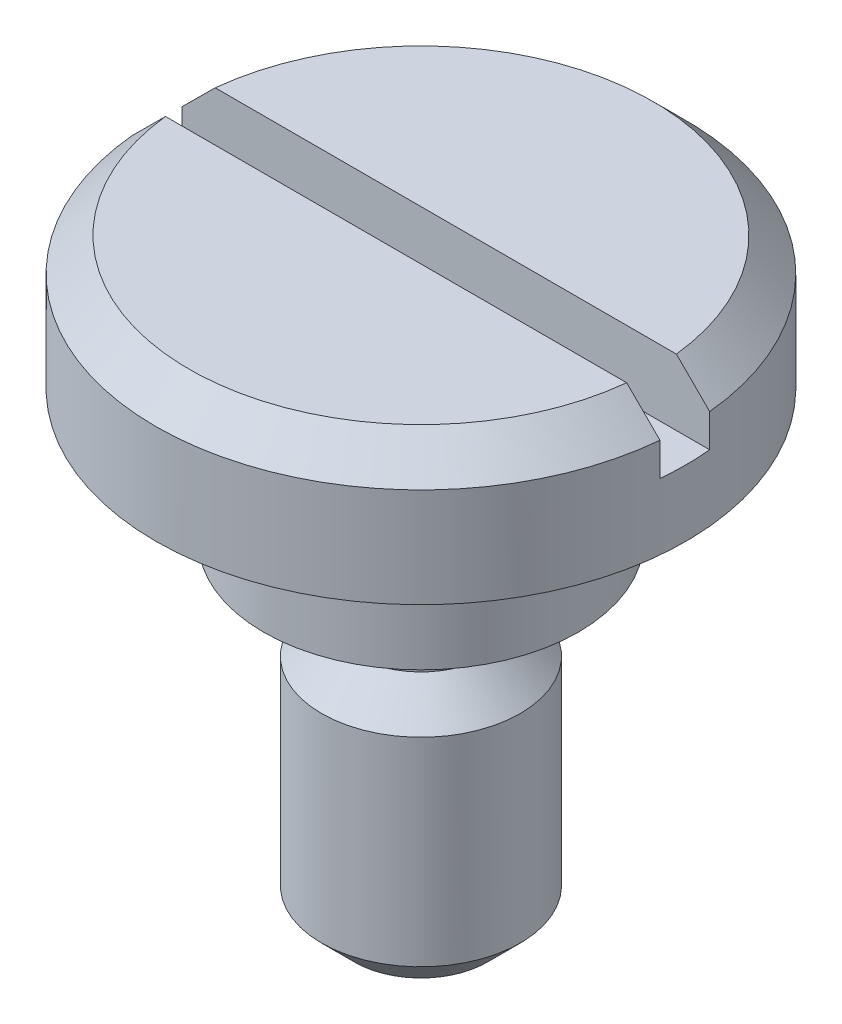
ISO-10303-21;
HEADER;
FILE_DESCRIPTION(('STEP AP214'),'2;1');
FILE_NAME('part.step','',(''),(''),'','','');
FILE_SCHEMA(('AUTOMOTIVE_DESIGN { 1 0 10303 214 1 1 1 1 }'));
ENDSEC;
DATA;
#1=APPLICATION_CONTEXT('core data for automotive mechanical design processes');
#2=APPLICATION_PROTOCOL_DEFINITION('international standard','automotive_design',2000,#1);
#3=PRODUCT_CONTEXT('',#1,'mechanical');
#4=PRODUCT('Part','Part','',(#3));
#5=PRODUCT_RELATED_PRODUCT_CATEGORY('part','',(#4));
#6=PRODUCT_DEFINITION_FORMATION('','',#4);
#7=PRODUCT_DEFINITION_CONTEXT('part definition',#1,'design');
#8=PRODUCT_DEFINITION('design','',#6,#7);
#9=PRODUCT_DEFINITION_SHAPE('','',#8);
#10=(LENGTH_UNIT() NAMED_UNIT(*) SI_UNIT(.MILLI.,.METRE.));
#11=(NAMED_UNIT(*) PLANE_ANGLE_UNIT() SI_UNIT($,.RADIAN.));
#12=(NAMED_UNIT(*) SI_UNIT($,.STERADIAN.) SOLID_ANGLE_UNIT());
#13=UNCERTAINTY_MEASURE_WITH_UNIT(LENGTH_MEASURE(1.E-05),#10,'distance_accuracy_value','');
#14=(GEOMETRIC_REPRESENTATION_CONTEXT(3) GLOBAL_UNCERTAINTY_ASSIGNED_CONTEXT((#13)) GLOBAL_UNIT_ASSIGNED_CONTEXT((#10,
#11,#12)) REPRESENTATION_CONTEXT('',''));
#15=CARTESIAN_POINT('',(0.,0.,0.));
#16=DIRECTION('',(0.,0.,1.));
#17=DIRECTION('',(1.,0.,0.));
#18=AXIS2_PLACEMENT_3D('',#15,#16,#17);
#19=CARTESIAN_POINT('',(8.,18.,0.));
#20=DIRECTION('',(0.,-1.,0.));
#21=DIRECTION('',(0.,0.,-1.));
#22=AXIS2_PLACEMENT_3D('',#19,#20,#21);
#23=PLANE('',#22);
#24=CARTESIAN_POINT('',(0.,18.,0.));
#25=DIRECTION('',(0.,-1.,0.));
#26=DIRECTION('',(0.,0.,-1.));
#27=AXIS2_PLACEMENT_3D('',#24,#25,#26);
#28=CIRCLE('',#27,7.);
#29=CARTESIAN_POINT('',(6.95970545353753,18.,-0.75));
#30=VERTEX_POINT('',#29);
#31=CARTESIAN_POINT('',(-6.95970545353753,18.,-0.75));
#32=VERTEX_POINT('',#31);
#33=EDGE_CURVE('E147',#30,#32,#28,.F.);
#34=ORIENTED_EDGE('',*,*,#33,.T.);
#35=DIRECTION('',(-1.,0.,0.));
#36=VECTOR('',#35,1.);
#37=CARTESIAN_POINT('',(-7.964766161037,18.,-0.75));
#38=LINE('',#37,#36);
#39=EDGE_CURVE('E108',#30,#32,#38,.T.);
#40=ORIENTED_EDGE('',*,*,#39,.F.);
#41=EDGE_LOOP('',(#34,#40));
#42=FACE_BOUND('',#41,.T.);
#43=ADVANCED_FACE('F34',(#42),#23,.F.);
#44=CARTESIAN_POINT('',(0.,18.,0.));
#45=DIRECTION('',(0.,-1.,0.));
#46=DIRECTION('',(0.,0.,-1.));
#47=AXIS2_PLACEMENT_3D('',#44,#45,#46);
#48=CONICAL_SURFACE('',#47,7.,0.785398163397447);
#49=CARTESIAN_POINT('',(17.5414999807444,7.44247393353899,-0.75));
#50=CARTESIAN_POINT('',(16.934728151679,8.04868746151241,-0.75));
#51=CARTESIAN_POINT('',(16.3279318310208,8.65487648238281,-0.75));
#52=CARTESIAN_POINT('',(15.1142562360308,9.86717583287513,-0.75));
#53=CARTESIAN_POINT('',(14.5073769614089,10.4732861622067,-0.75));
#54=CARTESIAN_POINT('',(13.2934560776545,11.6854437937345,-0.75));
#55=CARTESIAN_POINT('',(12.6864144592914,12.2914910866875,-0.75));
#56=CARTESIAN_POINT('',(11.4721610260657,13.5034109072837,-0.75));
#57=CARTESIAN_POINT('',(10.8649492118057,14.1092834355306,-0.75));
#58=CARTESIAN_POINT('',(9.65119667440748,15.3198088995362,-0.75));
#59=CARTESIAN_POINT('',(9.0446563796733,15.9244622647251,-0.75));
#60=CARTESIAN_POINT('',(8.13446986233438,16.831071345008,-0.75));
#61=CARTESIAN_POINT('',(7.83101003719044,17.1332141748789,-0.75));
#62=CARTESIAN_POINT('',(7.22391300253392,17.7373209392757,-0.75));
#63=CARTESIAN_POINT('',(6.92027579321098,18.0392848739921,-0.75));
#64=CARTESIAN_POINT('',(6.31275850317933,18.6429376578914,-0.75));
#65=CARTESIAN_POINT('',(6.00887843554389,18.9446265202264,-0.75));
#66=CARTESIAN_POINT('',(5.4007156174535,19.5476006086176,-0.75));
#67=CARTESIAN_POINT('',(5.09643286535552,19.8488858330169,-0.75));
#68=CARTESIAN_POINT('',(4.48721680699417,20.4507873145134,-0.75));
#69=CARTESIAN_POINT('',(4.18228351313859,20.7514035841502,-0.75));
#70=CARTESIAN_POINT('',(3.72395411736519,21.2013795844683,-0.75));
#71=CARTESIAN_POINT('',(3.57102325198566,21.3512130215695,-0.75));
#72=CARTESIAN_POINT('',(3.26470738597547,21.6504147852155,-0.75));
#73=CARTESIAN_POINT('',(3.11132238644353,21.7997831128838,-0.75));
#74=CARTESIAN_POINT('',(2.87344112197552,22.0303633901401,-0.75));
#75=CARTESIAN_POINT('',(2.78918674736266,22.1118248082896,-0.75));
#76=CARTESIAN_POINT('',(2.62040758518399,22.2744677855789,-0.75));
#77=CARTESIAN_POINT('',(2.53588279658871,22.3556493436509,-0.75));
#78=CARTESIAN_POINT('',(2.36644400534045,22.5176745333187,-0.75));
#79=CARTESIAN_POINT('',(2.28152985917243,22.5985180150561,-0.75));
#80=CARTESIAN_POINT('',(2.11121670939019,22.7596911220157,-0.75));
#81=CARTESIAN_POINT('',(2.02581770947637,22.8400207511496,-0.75));
#82=CARTESIAN_POINT('',(1.82527076370352,23.0270923741969,-0.75));
#83=CARTESIAN_POINT('',(1.70985722780419,23.133551452882,-0.75));
#84=CARTESIAN_POINT('',(1.53525461072994,23.2915201207219,-0.75));
#85=CARTESIAN_POINT('',(1.4768284843556,23.3438707141749,-0.75));
#86=CARTESIAN_POINT('',(1.35928034463948,23.4477787299597,-0.75));
#87=CARTESIAN_POINT('',(1.30015835814015,23.4993361827106,-0.75));
#88=CARTESIAN_POINT('',(1.15799131163724,23.621022220434,-0.75));
#89=CARTESIAN_POINT('',(1.0745091776994,23.6906488541161,-0.75));
#90=CARTESIAN_POINT('',(0.946894886136252,23.7923316941438,-0.75));
#91=CARTESIAN_POINT('',(0.903898977472858,23.8258095104373,-0.75));
#92=CARTESIAN_POINT('',(0.816885694502643,23.8914071251364,-0.75));
#93=CARTESIAN_POINT('',(0.772868497697684,23.9235271568294,-0.75));
#94=CARTESIAN_POINT('',(0.692982657221037,23.9791718137958,-0.75));
#95=CARTESIAN_POINT('',(0.65737565135847,24.003069880508,-0.75));
#96=CARTESIAN_POINT('',(0.585063694272162,24.0491992537746,-0.75));
#97=CARTESIAN_POINT('',(0.548358238710389,24.0714297777506,-0.75));
#98=CARTESIAN_POINT('',(0.473720096188374,24.1134547675553,-0.75));
#99=CARTESIAN_POINT('',(0.435791979005951,24.133257217005,-0.75));
#100=CARTESIAN_POINT('',(0.358375955998073,24.1694794840139,-0.75));
#101=CARTESIAN_POINT('',(0.318889927131749,24.1859032323201,-0.75));
#102=CARTESIAN_POINT('',(0.233864997275498,24.2154964657084,-0.75));
#103=CARTESIAN_POINT('',(0.188130389790622,24.2281300615748,-0.75));
#104=CARTESIAN_POINT('',(0.0952562653113295,24.2453353611093,-0.75));
#105=CARTESIAN_POINT('',(0.0481228412745304,24.2499379436973,-0.75));
#106=CARTESIAN_POINT('',(-0.0463420306781742,24.2500610091859,-0.75));
#107=CARTESIAN_POINT('',(-0.0936735338268117,24.2455459932391,-0.75));
#108=CARTESIAN_POINT('',(-0.186916004822306,24.2284362039912,-0.75));
#109=CARTESIAN_POINT('',(-0.232821637633051,24.2158142055641,-0.75));
#110=CARTESIAN_POINT('',(-0.326356777383562,24.183352972457,-0.75));
#111=CARTESIAN_POINT('',(-0.373795005324548,24.1629863962204,-0.75));
#112=CARTESIAN_POINT('',(-0.466480009797687,24.1176933624451,-0.75));
#113=CARTESIAN_POINT('',(-0.511722235371977,24.0927579074272,-0.75));
#114=CARTESIAN_POINT('',(-0.60077031443497,24.0397197682557,-0.75));
#115=CARTESIAN_POINT('',(-0.644561752123617,24.0115933045801,-0.75));
#116=CARTESIAN_POINT('',(-0.730728584600763,23.9533579234847,-0.75));
#117=CARTESIAN_POINT('',(-0.773105280843004,23.9232509082661,-0.75));
#118=CARTESIAN_POINT('',(-0.860966692603694,23.8586004765428,-0.75));
#119=CARTESIAN_POINT('',(-0.906344484700828,23.8239127286333,-0.75));
#120=CARTESIAN_POINT('',(-0.996179963196423,23.7533616832507,-0.75));
#121=CARTESIAN_POINT('',(-1.04063753157697,23.7174982365005,-0.75));
#122=CARTESIAN_POINT('',(-1.17301852220233,23.6086255494271,-0.75));
#123=CARTESIAN_POINT('',(-1.2599095777572,23.5343648950202,-0.75));
#124=CARTESIAN_POINT('',(-1.43218917663693,23.3838505880067,-0.75));
#125=CARTESIAN_POINT('',(-1.51757490297324,23.307593750691,-0.75));
#126=CARTESIAN_POINT('',(-1.6872501711054,23.1539173411141,-0.75));
#127=CARTESIAN_POINT('',(-1.77154000102016,23.0764980864864,-0.75));
#128=CARTESIAN_POINT('',(-1.93908533695122,22.9211600557452,-0.75));
#129=CARTESIAN_POINT('',(-2.02234349311562,22.8432441287644,-0.75));
#130=CARTESIAN_POINT('',(-2.1883514573688,22.686861916576,-0.75));
#131=CARTESIAN_POINT('',(-2.27110123054651,22.6083955943473,-0.75));
#132=CARTESIAN_POINT('',(-2.43614056869015,22.4511463950928,-0.75));
#133=CARTESIAN_POINT('',(-2.51843051238197,22.3723639151283,-0.75));
#134=CARTESIAN_POINT('',(-2.68272315787688,22.214503950753,-0.75));
#135=CARTESIAN_POINT('',(-2.76472586619171,22.1354264731149,-0.75));
#136=CARTESIAN_POINT('',(-3.00977722094826,21.8984658074307,-0.75));
#137=CARTESIAN_POINT('',(-3.17250263509665,21.7402484571436,-0.75));
#138=CARTESIAN_POINT('',(-3.49740744762284,21.4232538641054,-0.75));
#139=CARTESIAN_POINT('',(-3.65958684409579,21.2644766194051,-0.75));
#140=CARTESIAN_POINT('',(-4.14558747494641,20.7875862935705,-0.75));
#141=CARTESIAN_POINT('',(-4.46886563377819,20.468919985165,-0.75));
#142=CARTESIAN_POINT('',(-5.11481744847834,19.8307201509278,-0.75));
#143=CARTESIAN_POINT('',(-5.43749081303535,19.5111863307702,-0.75));
#144=CARTESIAN_POINT('',(-6.08239683995091,18.871679274844,-0.75));
#145=CARTESIAN_POINT('',(-6.40462950571272,18.5517060425074,-0.75));
#146=CARTESIAN_POINT('',(-7.04895014607176,17.9113517083914,-0.75));
#147=CARTESIAN_POINT('',(-7.37103800826922,17.5909704935642,-0.75));
#148=CARTESIAN_POINT('',(-8.01502708700071,16.95001921742,-0.75));
#149=CARTESIAN_POINT('',(-8.33692830314804,16.6294491557143,-0.75));
#150=CARTESIAN_POINT('',(-9.30236300677203,15.6676192714648,-0.75));
#151=CARTESIAN_POINT('',(-9.94570272604848,15.0261649744973,-0.75));
#152=CARTESIAN_POINT('',(-11.168707881798,13.8062110617127,-0.75));
#153=CARTESIAN_POINT('',(-11.7483995935197,13.2277377795248,-0.75));
#154=CARTESIAN_POINT('',(-12.9076562096521,12.0706208222212,-0.75));
#155=CARTESIAN_POINT('',(-13.4872211085099,11.4919771415424,-0.75));
#156=CARTESIAN_POINT('',(-14.6459557776394,10.3348859776015,-0.75));
#157=CARTESIAN_POINT('',(-15.2251255985507,9.75643854504722,-0.75));
#158=CARTESIAN_POINT('',(-16.3833711958862,8.59949298073518,-0.75));
#159=CARTESIAN_POINT('',(-16.9624469750233,8.02099485169352,-0.75));
#160=CARTESIAN_POINT('',(-17.5414999807444,7.44247393353899,-0.75));
#161=B_SPLINE_CURVE_WITH_KNOTS('',3,(#49,#50,#51,#52,#53,#54,#55,#56,#57,#58,#59,#60,#61,#62,
#63,#64,#65,#66,#67,#68,#69,#70,#71,#72,#73,#74,#75,#76,#77,#78,#79,#80,#81,#82,#83,#84,#85,#86,
#87,#88,#89,#90,#91,#92,#93,#94,#95,#96,#97,#98,#99,#100,#101,#102,#103,#104,#105,#106,#107,
#108,#109,#110,#111,#112,#113,#114,#115,#116,#117,#118,#119,#120,#121,#122,#123,#124,#125,#126,
#127,#128,#129,#130,#131,#132,#133,#134,#135,#136,#137,#138,#139,#140,#141,#142,#143,#144,#145,
#146,#147,#148,#149,#150,#151,#152,#153,#154,#155,#156,#157,#158,#159,#160),.UNSPECIFIED.,.F.,
.F.,(4,2,2,2,2,2,2,2,2,2,2,2,2,2,2,2,2,2,2,2,2,2,2,2,2,2,2,2,2,2,2,2,2,2,2,2,2,2,2,2,2,2,2,2,2,
2,2,2,2,2,2,2,2,2,2,4),(0.,2.57313079333365,5.14627082615952,7.7196218510383,10.2929638775751,
12.8622965532835,14.1469767696476,15.4316556150889,16.7162694249575,18.0008884925675,
19.2854832738205,19.9277764015614,20.5700679766136,20.9216536893458,21.2732407421641,
21.624969911041,21.9766963991221,22.4477226520162,22.6830624330438,22.9183931655176,
23.2444345257297,23.4078943970678,23.5713260684801,23.6999427338593,23.8286193862769,
23.956860902481,24.084952369373,24.2267429529488,24.367987146148,24.5097823257481,
24.6520561939772,24.8065659402138,24.9613832977728,25.1174412949235,25.2733515363281,
25.4446757166793,25.6160217347512,25.958866897718,26.3022971092459,26.6456351264356,
26.9877217466527,27.3298316013911,27.671597873188,28.013356346195,28.6942433756894,
29.3751327780866,30.7369346679044,32.0992777814276,33.4616103142851,34.8244977613737,
36.1873880219317,38.9128504459929,41.3696907461415,43.8266229233735,46.2823004252135,
48.7378858030532),.UNSPECIFIED.);
#162=CARTESIAN_POINT('',(7.964766161037,17.,-0.75));
#163=VERTEX_POINT('',#162);
#164=EDGE_CURVE('E11',#163,#30,#161,.T.);
#165=ORIENTED_EDGE('',*,*,#164,.F.);
#166=CARTESIAN_POINT('',(0.,17.,0.));
#167=DIRECTION('',(0.,-1.,0.));
#168=DIRECTION('',(0.,0.,-1.));
#169=AXIS2_PLACEMENT_3D('',#166,#167,#168);
#170=CIRCLE('',#169,8.);
#171=CARTESIAN_POINT('',(-7.964766161037,17.,-0.75));
#172=VERTEX_POINT('',#171);
#173=EDGE_CURVE('E151',#172,#163,#170,.T.);
#174=ORIENTED_EDGE('',*,*,#173,.F.);
#175=EDGE_CURVE('E39',#32,#172,#161,.T.);
#176=ORIENTED_EDGE('',*,*,#175,.F.);
#177=ORIENTED_EDGE('',*,*,#33,.F.);
#178=EDGE_LOOP('',(#165,#174,#176,#177));
#179=FACE_BOUND('',#178,.T.);
#180=ADVANCED_FACE('F195',(#179),#48,.T.);
#181=CARTESIAN_POINT('',(0.,0.,0.));
#182=DIRECTION('',(0.,1.,0.));
#183=DIRECTION('',(0.,0.,1.));
#184=AXIS2_PLACEMENT_3D('',#181,#182,#183);
#185=PLANE('',#184);
#186=CARTESIAN_POINT('',(0.,0.,0.));
#187=DIRECTION('',(0.,1.,0.));
#188=DIRECTION('',(0.,0.,1.));
#189=AXIS2_PLACEMENT_3D('',#186,#187,#188);
#190=CIRCLE('',#189,2.);
#191=CARTESIAN_POINT('',(0.,0.,2.));
#192=VERTEX_POINT('',#191);
#193=EDGE_CURVE('E144',#192,#192,#190,.F.);
#194=ORIENTED_EDGE('',*,*,#193,.T.);
#195=EDGE_LOOP('',(#194));
#196=FACE_BOUND('',#195,.T.);
#197=ADVANCED_FACE('F191',(#196),#185,.F.);
#198=CARTESIAN_POINT('',(0.,18.,0.));
#199=DIRECTION('',(0.,1.,0.));
#200=DIRECTION('',(0.,0.,1.));
#201=AXIS2_PLACEMENT_3D('',#198,#199,#200);
#202=CYLINDRICAL_SURFACE('',#201,3.);
#203=CARTESIAN_POINT('',(0.,6.99999999999999,0.));
#204=DIRECTION('',(0.,-1.,0.));
#205=DIRECTION('',(0.,0.,-1.));
#206=AXIS2_PLACEMENT_3D('',#203,#204,#205);
#207=CIRCLE('',#206,3.);
#208=CARTESIAN_POINT('',(0.,6.99999999999999,-3.));
#209=VERTEX_POINT('',#208);
#210=EDGE_CURVE('E141',#209,#209,#207,.T.);
#211=ORIENTED_EDGE('',*,*,#210,.T.);
#212=EDGE_LOOP('',(#211));
#213=FACE_BOUND('',#212,.T.);
#214=CARTESIAN_POINT('',(0.,0.999999999999997,0.));
#215=DIRECTION('',(0.,1.,0.));
#216=DIRECTION('',(0.,0.,1.));
#217=AXIS2_PLACEMENT_3D('',#214,#215,#216);
#218=CIRCLE('',#217,3.);
#219=CARTESIAN_POINT('',(0.,0.999999999999997,3.));
#220=VERTEX_POINT('',#219);
#221=EDGE_CURVE('E138',#220,#220,#218,.T.);
#222=ORIENTED_EDGE('',*,*,#221,.T.);
#223=EDGE_LOOP('',(#222));
#224=FACE_BOUND('',#223,.T.);
#225=ADVANCED_FACE('F187',(#213,#224),#202,.T.);
#226=CARTESIAN_POINT('',(0.,18.,0.));
#227=DIRECTION('',(0.,1.,0.));
#228=DIRECTION('',(0.,0.,1.));
#229=AXIS2_PLACEMENT_3D('',#226,#227,#228);
#230=CYLINDRICAL_SURFACE('',#229,2.);
#231=CARTESIAN_POINT('',(0.,10.,0.));
#232=DIRECTION('',(0.,1.,0.));
#233=DIRECTION('',(0.,0.,1.));
#234=AXIS2_PLACEMENT_3D('',#231,#232,#233);
#235=CIRCLE('',#234,2.);
#236=CARTESIAN_POINT('',(0.,10.,2.));
#237=VERTEX_POINT('',#236);
#238=EDGE_CURVE('E132',#237,#237,#235,.T.);
#239=ORIENTED_EDGE('',*,*,#238,.F.);
#240=EDGE_LOOP('',(#239));
#241=FACE_BOUND('',#240,.T.);
#242=CARTESIAN_POINT('',(0.,8.,0.));
#243=DIRECTION('',(0.,1.,0.));
#244=DIRECTION('',(0.,0.,1.));
#245=AXIS2_PLACEMENT_3D('',#242,#243,#244);
#246=CIRCLE('',#245,2.);
#247=CARTESIAN_POINT('',(0.,8.,2.));
#248=VERTEX_POINT('',#247);
#249=EDGE_CURVE('E135',#248,#248,#246,.T.);
#250=ORIENTED_EDGE('',*,*,#249,.T.);
#251=EDGE_LOOP('',(#250));
#252=FACE_BOUND('',#251,.T.);
#253=ADVANCED_FACE('F183',(#241,#252),#230,.T.);
#254=CARTESIAN_POINT('',(2.,10.,0.));
#255=DIRECTION('',(0.,1.,0.));
#256=DIRECTION('',(0.,0.,1.));
#257=AXIS2_PLACEMENT_3D('',#254,#255,#256);
#258=PLANE('',#257);
#259=CARTESIAN_POINT('',(0.,10.,0.));
#260=DIRECTION('',(0.,1.,0.));
#261=DIRECTION('',(0.,0.,1.));
#262=AXIS2_PLACEMENT_3D('',#259,#260,#261);
#263=CIRCLE('',#262,4.75);
#264=CARTESIAN_POINT('',(0.,10.,4.75));
#265=VERTEX_POINT('',#264);
#266=EDGE_CURVE('E129',#265,#265,#263,.T.);
#267=ORIENTED_EDGE('',*,*,#266,.F.);
#268=EDGE_LOOP('',(#267));
#269=FACE_BOUND('',#268,.T.);
#270=ORIENTED_EDGE('',*,*,#238,.T.);
#271=EDGE_LOOP('',(#270));
#272=FACE_BOUND('',#271,.T.);
#273=ADVANCED_FACE('F179',(#269,#272),#258,.F.);
#274=CARTESIAN_POINT('',(0.,18.,0.));
#275=DIRECTION('',(0.,1.,0.));
#276=DIRECTION('',(0.,0.,1.));
#277=AXIS2_PLACEMENT_3D('',#274,#275,#276);
#278=CYLINDRICAL_SURFACE('',#277,4.75);
#279=CARTESIAN_POINT('',(0.,14.,0.));
#280=DIRECTION('',(0.,1.,0.));
#281=DIRECTION('',(0.,0.,1.));
#282=AXIS2_PLACEMENT_3D('',#279,#280,#281);
#283=CIRCLE('',#282,4.75);
#284=CARTESIAN_POINT('',(0.,14.,4.75));
#285=VERTEX_POINT('',#284);
#286=EDGE_CURVE('E125',#285,#285,#283,.T.);
#287=ORIENTED_EDGE('',*,*,#286,.F.);
#288=EDGE_LOOP('',(#287));
#289=FACE_BOUND('',#288,.T.);
#290=ORIENTED_EDGE('',*,*,#266,.T.);
#291=EDGE_LOOP('',(#290));
#292=FACE_BOUND('',#291,.T.);
#293=ADVANCED_FACE('F175',(#289,#292),#278,.T.);
#294=CARTESIAN_POINT('',(4.75,14.,0.));
#295=DIRECTION('',(0.,1.,0.));
#296=DIRECTION('',(0.,0.,1.));
#297=AXIS2_PLACEMENT_3D('',#294,#295,#296);
#298=PLANE('',#297);
#299=CARTESIAN_POINT('',(0.,14.,0.));
#300=DIRECTION('',(0.,1.,0.));
#301=DIRECTION('',(0.,0.,1.));
#302=AXIS2_PLACEMENT_3D('',#299,#300,#301);
#303=CIRCLE('',#302,8.);
#304=CARTESIAN_POINT('',(0.,14.,8.));
#305=VERTEX_POINT('',#304);
#306=EDGE_CURVE('E122',#305,#305,#303,.T.);
#307=ORIENTED_EDGE('',*,*,#306,.F.);
#308=EDGE_LOOP('',(#307));
#309=FACE_BOUND('',#308,.T.);
#310=ORIENTED_EDGE('',*,*,#286,.T.);
#311=EDGE_LOOP('',(#310));
#312=FACE_BOUND('',#311,.T.);
#313=ADVANCED_FACE('F172',(#309,#312),#298,.F.);
#314=CARTESIAN_POINT('',(0.,18.,0.));
#315=DIRECTION('',(0.,1.,0.));
#316=DIRECTION('',(0.,0.,1.));
#317=AXIS2_PLACEMENT_3D('',#314,#315,#316);
#318=CYLINDRICAL_SURFACE('',#317,8.);
#319=ORIENTED_EDGE('',*,*,#173,.T.);
#320=DIRECTION('',(0.,1.,0.));
#321=VECTOR('',#320,1.);
#322=CARTESIAN_POINT('',(7.964766161037,16.,-0.75));
#323=LINE('',#322,#321);
#324=CARTESIAN_POINT('',(7.964766161037,16.,-0.75));
#325=VERTEX_POINT('',#324);
#326=EDGE_CURVE('E117',#325,#163,#323,.T.);
#327=ORIENTED_EDGE('',*,*,#326,.F.);
#328=CARTESIAN_POINT('',(0.,16.,0.));
#329=DIRECTION('',(0.,1.,0.));
#330=DIRECTION('',(0.,0.,1.));
#331=AXIS2_PLACEMENT_3D('',#328,#329,#330);
#332=CIRCLE('',#331,8.);
#333=CARTESIAN_POINT('',(7.964766161037,16.,0.75));
#334=VERTEX_POINT('',#333);
#335=EDGE_CURVE('E99',#334,#325,#332,.T.);
#336=ORIENTED_EDGE('',*,*,#335,.F.);
#337=DIRECTION('',(0.,1.,0.));
#338=VECTOR('',#337,1.);
#339=CARTESIAN_POINT('',(7.964766161037,16.,0.75));
#340=LINE('',#339,#338);
#341=CARTESIAN_POINT('',(7.964766161037,17.,0.75));
#342=VERTEX_POINT('',#341);
#343=EDGE_CURVE('E96',#334,#342,#340,.T.);
#344=ORIENTED_EDGE('',*,*,#343,.T.);
#345=CARTESIAN_POINT('',(-7.964766161037,17.,0.75));
#346=VERTEX_POINT('',#345);
#347=EDGE_CURVE('E115',#342,#346,#170,.T.);
#348=ORIENTED_EDGE('',*,*,#347,.T.);
#349=DIRECTION('',(0.,1.,0.));
#350=VECTOR('',#349,1.);
#351=CARTESIAN_POINT('',(-7.964766161037,16.,0.75));
#352=LINE('',#351,#350);
#353=CARTESIAN_POINT('',(-7.964766161037,16.,0.75));
#354=VERTEX_POINT('',#353);
#355=EDGE_CURVE('E93',#354,#346,#352,.T.);
#356=ORIENTED_EDGE('',*,*,#355,.F.);
#357=CARTESIAN_POINT('',(0.,16.,0.));
#358=DIRECTION('',(0.,1.,0.));
#359=DIRECTION('',(0.,0.,1.));
#360=AXIS2_PLACEMENT_3D('',#357,#358,#359);
#361=CIRCLE('',#360,8.);
#362=CARTESIAN_POINT('',(-7.964766161037,16.,-0.75));
#363=VERTEX_POINT('',#362);
#364=EDGE_CURVE('E100',#363,#354,#361,.T.);
#365=ORIENTED_EDGE('',*,*,#364,.F.);
#366=DIRECTION('',(0.,1.,0.));
#367=VECTOR('',#366,1.);
#368=CARTESIAN_POINT('',(-7.964766161037,16.,-0.75));
#369=LINE('',#368,#367);
#370=EDGE_CURVE('E126',#363,#172,#369,.T.);
#371=ORIENTED_EDGE('',*,*,#370,.T.);
#372=EDGE_LOOP('',(#319,#327,#336,#344,#348,#356,#365,#371));
#373=FACE_BOUND('',#372,.T.);
#374=ORIENTED_EDGE('',*,*,#306,.T.);
#375=EDGE_LOOP('',(#374));
#376=FACE_BOUND('',#375,.T.);
#377=ADVANCED_FACE('F112',(#373,#376),#318,.T.);
#378=CARTESIAN_POINT('',(-6.95970545353753,18.,0.75));
#379=VERTEX_POINT('',#378);
#380=CARTESIAN_POINT('',(6.95970545353753,18.,0.75));
#381=VERTEX_POINT('',#380);
#382=EDGE_CURVE('E150',#379,#381,#28,.F.);
#383=ORIENTED_EDGE('',*,*,#382,.T.);
#384=DIRECTION('',(1.,0.,0.));
#385=VECTOR('',#384,1.);
#386=CARTESIAN_POINT('',(-7.964766161037,18.,0.75));
#387=LINE('',#386,#385);
#388=EDGE_CURVE('E55',#379,#381,#387,.T.);
#389=ORIENTED_EDGE('',*,*,#388,.F.);
#390=EDGE_LOOP('',(#383,#389));
#391=FACE_BOUND('',#390,.T.);
#392=ADVANCED_FACE('F165',(#391),#23,.F.);
#393=CARTESIAN_POINT('',(0.,8.,0.));
#394=DIRECTION('',(0.,-1.,0.));
#395=DIRECTION('',(0.,0.,-1.));
#396=AXIS2_PLACEMENT_3D('',#393,#394,#395);
#397=CONICAL_SURFACE('',#396,1.99999999999999,0.785398163397446);
#398=ORIENTED_EDGE('',*,*,#210,.F.);
#399=EDGE_LOOP('',(#398));
#400=FACE_BOUND('',#399,.T.);
#401=ORIENTED_EDGE('',*,*,#249,.F.);
#402=EDGE_LOOP('',(#401));
#403=FACE_BOUND('',#402,.T.);
#404=ADVANCED_FACE('F168',(#400,#403),#397,.T.);
#405=CARTESIAN_POINT('',(0.,0.999999999999997,0.));
#406=DIRECTION('',(0.,1.,0.));
#407=DIRECTION('',(0.,0.,1.));
#408=AXIS2_PLACEMENT_3D('',#405,#406,#407);
#409=CONICAL_SURFACE('',#408,3.,0.785398163397449);
#410=ORIENTED_EDGE('',*,*,#193,.F.);
#411=EDGE_LOOP('',(#410));
#412=FACE_BOUND('',#411,.T.);
#413=ORIENTED_EDGE('',*,*,#221,.F.);
#414=EDGE_LOOP('',(#413));
#415=FACE_BOUND('',#414,.T.);
#416=ADVANCED_FACE('F198',(#412,#415),#409,.T.);
#417=CARTESIAN_POINT('',(-17.5414999807444,7.44247393353899,0.75));
#418=CARTESIAN_POINT('',(-16.934728151679,8.04868746151241,0.75));
#419=CARTESIAN_POINT('',(-16.3279318310208,8.65487648238281,0.75));
#420=CARTESIAN_POINT('',(-15.1142562360308,9.86717583287513,0.75));
#421=CARTESIAN_POINT('',(-14.5073769614089,10.4732861622067,0.75));
#422=CARTESIAN_POINT('',(-13.2934560776545,11.6854437937345,0.75));
#423=CARTESIAN_POINT('',(-12.6864144592914,12.2914910866875,0.75));
#424=CARTESIAN_POINT('',(-11.4721610260657,13.5034109072837,0.75));
#425=CARTESIAN_POINT('',(-10.8649492118057,14.1092834355306,0.75));
#426=CARTESIAN_POINT('',(-9.65119667440748,15.3198088995362,0.75));
#427=CARTESIAN_POINT('',(-9.0446563796733,15.9244622647251,0.75));
#428=CARTESIAN_POINT('',(-8.13446986233438,16.831071345008,0.75));
#429=CARTESIAN_POINT('',(-7.83101003719044,17.1332141748789,0.75));
#430=CARTESIAN_POINT('',(-7.22391300253392,17.7373209392757,0.75));
#431=CARTESIAN_POINT('',(-6.92027579321098,18.0392848739921,0.75));
#432=CARTESIAN_POINT('',(-6.31275850317933,18.6429376578914,0.75));
#433=CARTESIAN_POINT('',(-6.00887843554389,18.9446265202264,0.75));
#434=CARTESIAN_POINT('',(-5.4007156174535,19.5476006086176,0.75));
#435=CARTESIAN_POINT('',(-5.09643286535552,19.8488858330169,0.75));
#436=CARTESIAN_POINT('',(-4.48721680699417,20.4507873145134,0.75));
#437=CARTESIAN_POINT('',(-4.18228351313859,20.7514035841502,0.75));
#438=CARTESIAN_POINT('',(-3.72395411736519,21.2013795844683,0.75));
#439=CARTESIAN_POINT('',(-3.57102325198566,21.3512130215695,0.75));
#440=CARTESIAN_POINT('',(-3.26470738597547,21.6504147852155,0.75));
#441=CARTESIAN_POINT('',(-3.11132238644353,21.7997831128838,0.75));
#442=CARTESIAN_POINT('',(-2.87344112197552,22.0303633901401,0.75));
#443=CARTESIAN_POINT('',(-2.78918674736266,22.1118248082896,0.75));
#444=CARTESIAN_POINT('',(-2.62040758518399,22.2744677855789,0.75));
#445=CARTESIAN_POINT('',(-2.53588279658871,22.3556493436509,0.75));
#446=CARTESIAN_POINT('',(-2.36644400534045,22.5176745333187,0.75));
#447=CARTESIAN_POINT('',(-2.28152985917243,22.5985180150561,0.75));
#448=CARTESIAN_POINT('',(-2.11121670939019,22.7596911220157,0.75));
#449=CARTESIAN_POINT('',(-2.02581770947637,22.8400207511496,0.75));
#450=CARTESIAN_POINT('',(-1.82527076370352,23.0270923741969,0.75));
#451=CARTESIAN_POINT('',(-1.70985722780419,23.133551452882,0.75));
#452=CARTESIAN_POINT('',(-1.53525461072994,23.2915201207219,0.75));
#453=CARTESIAN_POINT('',(-1.4768284843556,23.3438707141749,0.75));
#454=CARTESIAN_POINT('',(-1.35928034463948,23.4477787299597,0.75));
#455=CARTESIAN_POINT('',(-1.30015835814015,23.4993361827106,0.75));
#456=CARTESIAN_POINT('',(-1.15799131163724,23.621022220434,0.75));
#457=CARTESIAN_POINT('',(-1.0745091776994,23.6906488541161,0.75));
#458=CARTESIAN_POINT('',(-0.946894886136252,23.7923316941438,0.75));
#459=CARTESIAN_POINT('',(-0.903898977472858,23.8258095104373,0.75));
#460=CARTESIAN_POINT('',(-0.816885694502643,23.8914071251364,0.75));
#461=CARTESIAN_POINT('',(-0.772868497697684,23.9235271568294,0.75));
#462=CARTESIAN_POINT('',(-0.692982657221037,23.9791718137958,0.75));
#463=CARTESIAN_POINT('',(-0.65737565135847,24.003069880508,0.75));
#464=CARTESIAN_POINT('',(-0.585063694272162,24.0491992537746,0.75));
#465=CARTESIAN_POINT('',(-0.548358238710389,24.0714297777506,0.75));
#466=CARTESIAN_POINT('',(-0.473720096188374,24.1134547675553,0.75));
#467=CARTESIAN_POINT('',(-0.435791979005951,24.133257217005,0.75));
#468=CARTESIAN_POINT('',(-0.358375955998073,24.1694794840139,0.75));
#469=CARTESIAN_POINT('',(-0.318889927131749,24.1859032323201,0.75));
#470=CARTESIAN_POINT('',(-0.233864997275498,24.2154964657084,0.75));
#471=CARTESIAN_POINT('',(-0.188130389790622,24.2281300615748,0.75));
#472=CARTESIAN_POINT('',(-0.0952562653113295,24.2453353611093,0.75));
#473=CARTESIAN_POINT('',(-0.0481228412745304,24.2499379436973,0.75));
#474=CARTESIAN_POINT('',(0.0463420306781742,24.2500610091859,0.75));
#475=CARTESIAN_POINT('',(0.0936735338268117,24.2455459932391,0.75));
#476=CARTESIAN_POINT('',(0.186916004822306,24.2284362039912,0.75));
#477=CARTESIAN_POINT('',(0.232821637633051,24.2158142055641,0.75));
#478=CARTESIAN_POINT('',(0.326356777383562,24.183352972457,0.75));
#479=CARTESIAN_POINT('',(0.373795005324548,24.1629863962204,0.75));
#480=CARTESIAN_POINT('',(0.466480009797687,24.1176933624451,0.75));
#481=CARTESIAN_POINT('',(0.511722235371977,24.0927579074272,0.75));
#482=CARTESIAN_POINT('',(0.60077031443497,24.0397197682557,0.75));
#483=CARTESIAN_POINT('',(0.644561752123617,24.0115933045801,0.75));
#484=CARTESIAN_POINT('',(0.730728584600763,23.9533579234847,0.75));
#485=CARTESIAN_POINT('',(0.773105280843004,23.9232509082661,0.75));
#486=CARTESIAN_POINT('',(0.860966692603694,23.8586004765428,0.75));
#487=CARTESIAN_POINT('',(0.906344484700828,23.8239127286333,0.75));
#488=CARTESIAN_POINT('',(0.996179963196423,23.7533616832507,0.75));
#489=CARTESIAN_POINT('',(1.04063753157697,23.7174982365005,0.75));
#490=CARTESIAN_POINT('',(1.17301852220233,23.6086255494271,0.75));
#491=CARTESIAN_POINT('',(1.2599095777572,23.5343648950202,0.75));
#492=CARTESIAN_POINT('',(1.43218917663693,23.3838505880067,0.75));
#493=CARTESIAN_POINT('',(1.51757490297324,23.307593750691,0.75));
#494=CARTESIAN_POINT('',(1.6872501711054,23.1539173411141,0.75));
#495=CARTESIAN_POINT('',(1.77154000102016,23.0764980864864,0.75));
#496=CARTESIAN_POINT('',(1.93908533695122,22.9211600557452,0.75));
#497=CARTESIAN_POINT('',(2.02234349311562,22.8432441287644,0.75));
#498=CARTESIAN_POINT('',(2.1883514573688,22.686861916576,0.75));
#499=CARTESIAN_POINT('',(2.27110123054651,22.6083955943473,0.75));
#500=CARTESIAN_POINT('',(2.43614056869015,22.4511463950928,0.75));
#501=CARTESIAN_POINT('',(2.51843051238197,22.3723639151283,0.75));
#502=CARTESIAN_POINT('',(2.68272315787688,22.214503950753,0.75));
#503=CARTESIAN_POINT('',(2.76472586619171,22.1354264731149,0.75));
#504=CARTESIAN_POINT('',(3.00977722094826,21.8984658074307,0.75));
#505=CARTESIAN_POINT('',(3.17250263509665,21.7402484571436,0.75));
#506=CARTESIAN_POINT('',(3.49740744762284,21.4232538641054,0.75));
#507=CARTESIAN_POINT('',(3.65958684409579,21.2644766194051,0.75));
#508=CARTESIAN_POINT('',(4.14558747494641,20.7875862935705,0.75));
#509=CARTESIAN_POINT('',(4.46886563377819,20.468919985165,0.75));
#510=CARTESIAN_POINT('',(5.11481744847834,19.8307201509278,0.75));
#511=CARTESIAN_POINT('',(5.43749081303535,19.5111863307702,0.75));
#512=CARTESIAN_POINT('',(6.08239683995091,18.871679274844,0.75));
#513=CARTESIAN_POINT('',(6.40462950571272,18.5517060425074,0.75));
#514=CARTESIAN_POINT('',(7.04895014607176,17.9113517083914,0.75));
#515=CARTESIAN_POINT('',(7.37103800826922,17.5909704935642,0.75));
#516=CARTESIAN_POINT('',(8.01502708700071,16.95001921742,0.75));
#517=CARTESIAN_POINT('',(8.33692830314804,16.6294491557143,0.75));
#518=CARTESIAN_POINT('',(9.30236300677203,15.6676192714648,0.75));
#519=CARTESIAN_POINT('',(9.94570272604848,15.0261649744973,0.75));
#520=CARTESIAN_POINT('',(11.168707881798,13.8062110617127,0.75));
#521=CARTESIAN_POINT('',(11.7483995935197,13.2277377795248,0.75));
#522=CARTESIAN_POINT('',(12.9076562096521,12.0706208222212,0.75));
#523=CARTESIAN_POINT('',(13.4872211085099,11.4919771415424,0.75));
#524=CARTESIAN_POINT('',(14.6459557776394,10.3348859776015,0.75));
#525=CARTESIAN_POINT('',(15.2251255985507,9.75643854504722,0.75));
#526=CARTESIAN_POINT('',(16.3833711958862,8.59949298073518,0.75));
#527=CARTESIAN_POINT('',(16.9624469750233,8.02099485169352,0.75));
#528=CARTESIAN_POINT('',(17.5414999807444,7.44247393353899,0.75));
#529=B_SPLINE_CURVE_WITH_KNOTS('',3,(#417,#418,#419,#420,#421,#422,#423,#424,#425,#426,#427,
#428,#429,#430,#431,#432,#433,#434,#435,#436,#437,#438,#439,#440,#441,#442,#443,#444,#445,#446,
#447,#448,#449,#450,#451,#452,#453,#454,#455,#456,#457,#458,#459,#460,#461,#462,#463,#464,#465,
#466,#467,#468,#469,#470,#471,#472,#473,#474,#475,#476,#477,#478,#479,#480,#481,#482,#483,#484,
#485,#486,#487,#488,#489,#490,#491,#492,#493,#494,#495,#496,#497,#498,#499,#500,#501,#502,#503,
#504,#505,#506,#507,#508,#509,#510,#511,#512,#513,#514,#515,#516,#517,#518,#519,#520,#521,#522,
#523,#524,#525,#526,#527,#528),.UNSPECIFIED.,.F.,.F.,(4,2,2,2,2,2,2,2,2,2,2,2,2,2,2,2,2,2,2,2,2,
2,2,2,2,2,2,2,2,2,2,2,2,2,2,2,2,2,2,2,2,2,2,2,2,2,2,2,2,2,2,2,2,2,2,4),(0.,2.57313079333365,
5.14627082615952,7.7196218510383,10.2929638775751,12.8622965532835,14.1469767696476,
15.4316556150889,16.7162694249575,18.0008884925675,19.2854832738205,19.9277764015614,
20.5700679766136,20.9216536893458,21.2732407421641,21.624969911041,21.9766963991221,
22.4477226520162,22.6830624330438,22.9183931655176,23.2444345257297,23.4078943970678,
23.5713260684801,23.6999427338593,23.8286193862769,23.956860902481,24.084952369373,
24.2267429529488,24.367987146148,24.5097823257481,24.6520561939772,24.8065659402138,
24.9613832977728,25.1174412949235,25.2733515363281,25.4446757166793,25.6160217347512,
25.958866897718,26.3022971092459,26.6456351264356,26.9877217466527,27.3298316013911,
27.671597873188,28.013356346195,28.6942433756894,29.3751327780866,30.7369346679044,
32.0992777814276,33.4616103142851,34.8244977613737,36.1873880219317,38.9128504459929,
41.3696907461415,43.8266229233735,46.2823004252135,48.7378858030532),.UNSPECIFIED.);
#530=EDGE_CURVE('E158',#346,#379,#529,.T.);
#531=ORIENTED_EDGE('',*,*,#530,.F.);
#532=ORIENTED_EDGE('',*,*,#347,.F.);
#533=EDGE_CURVE('E152',#381,#342,#529,.T.);
#534=ORIENTED_EDGE('',*,*,#533,.F.);
#535=ORIENTED_EDGE('',*,*,#382,.F.);
#536=EDGE_LOOP('',(#531,#532,#534,#535));
#537=FACE_BOUND('',#536,.T.);
#538=ADVANCED_FACE('F36',(#537),#48,.T.);
#539=CARTESIAN_POINT('',(-7.964766161037,16.,-0.75));
#540=DIRECTION('',(0.,0.,-1.));
#541=DIRECTION('',(-1.,0.,0.));
#542=AXIS2_PLACEMENT_3D('',#539,#540,#541);
#543=PLANE('',#542);
#544=ORIENTED_EDGE('',*,*,#164,.T.);
#545=ORIENTED_EDGE('',*,*,#39,.T.);
#546=ORIENTED_EDGE('',*,*,#175,.T.);
#547=ORIENTED_EDGE('',*,*,#370,.F.);
#548=DIRECTION('',(-1.,0.,0.));
#549=VECTOR('',#548,1.);
#550=CARTESIAN_POINT('',(-7.964766161037,16.,-0.75));
#551=LINE('',#550,#549);
#552=EDGE_CURVE('E106',#325,#363,#551,.T.);
#553=ORIENTED_EDGE('',*,*,#552,.F.);
#554=ORIENTED_EDGE('',*,*,#326,.T.);
#555=EDGE_LOOP('',(#544,#545,#546,#547,#553,#554));
#556=FACE_BOUND('',#555,.T.);
#557=ADVANCED_FACE('F162',(#556),#543,.F.);
#558=CARTESIAN_POINT('',(-7.964766161037,16.,0.75));
#559=DIRECTION('',(0.,0.,1.));
#560=DIRECTION('',(1.,0.,0.));
#561=AXIS2_PLACEMENT_3D('',#558,#559,#560);
#562=PLANE('',#561);
#563=ORIENTED_EDGE('',*,*,#530,.T.);
#564=ORIENTED_EDGE('',*,*,#388,.T.);
#565=ORIENTED_EDGE('',*,*,#533,.T.);
#566=ORIENTED_EDGE('',*,*,#343,.F.);
#567=DIRECTION('',(1.,0.,0.));
#568=VECTOR('',#567,1.);
#569=CARTESIAN_POINT('',(-7.964766161037,16.,0.75));
#570=LINE('',#569,#568);
#571=EDGE_CURVE('E89',#354,#334,#570,.T.);
#572=ORIENTED_EDGE('',*,*,#571,.F.);
#573=ORIENTED_EDGE('',*,*,#355,.T.);
#574=EDGE_LOOP('',(#563,#564,#565,#566,#572,#573));
#575=FACE_BOUND('',#574,.T.);
#576=ADVANCED_FACE('F91',(#575),#562,.F.);
#577=CARTESIAN_POINT('',(0.,16.,0.));
#578=DIRECTION('',(0.,1.,0.));
#579=DIRECTION('',(0.,0.,1.));
#580=AXIS2_PLACEMENT_3D('',#577,#578,#579);
#581=PLANE('',#580);
#582=ORIENTED_EDGE('',*,*,#364,.T.);
#583=ORIENTED_EDGE('',*,*,#571,.T.);
#584=ORIENTED_EDGE('',*,*,#335,.T.);
#585=ORIENTED_EDGE('',*,*,#552,.T.);
#586=EDGE_LOOP('',(#582,#583,#584,#585));
#587=FACE_BOUND('',#586,.T.);
#588=ADVANCED_FACE('F104',(#587),#581,.T.);
#589=CLOSED_SHELL('',(#43,#180,#197,#225,#253,#273,#293,#313,#377,#392,#404,#416,#538,#557,#576,#588));
#590=MANIFOLD_SOLID_BREP('B2',#589);
#591=ADVANCED_BREP_SHAPE_REPRESENTATION('',(#18,#590),#14);
#592=SHAPE_DEFINITION_REPRESENTATION(#9,#591);
ENDSEC;
END-ISO-10303-21;
